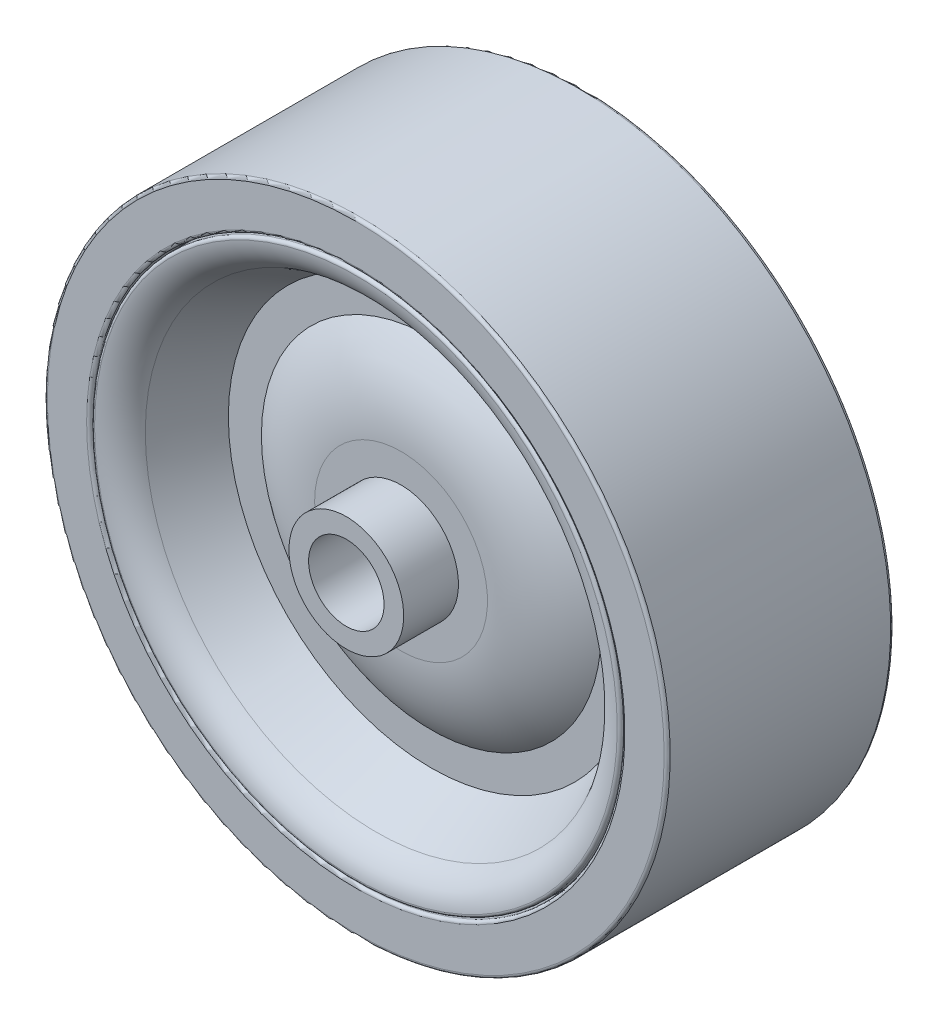
ISO-10303-21;
HEADER;
FILE_DESCRIPTION(('STEP AP214'),'2;1');
FILE_NAME('part.step','',(''),(''),'','','');
FILE_SCHEMA(('AUTOMOTIVE_DESIGN { 1 0 10303 214 1 1 1 1 }'));
ENDSEC;
DATA;
#1=APPLICATION_CONTEXT('core data for automotive mechanical design processes');
#2=APPLICATION_PROTOCOL_DEFINITION('international standard','automotive_design',2000,#1);
#3=PRODUCT_CONTEXT('',#1,'mechanical');
#4=PRODUCT('Part','Part','',(#3));
#5=PRODUCT_RELATED_PRODUCT_CATEGORY('part','',(#4));
#6=PRODUCT_DEFINITION_FORMATION('','',#4);
#7=PRODUCT_DEFINITION_CONTEXT('part definition',#1,'design');
#8=PRODUCT_DEFINITION('design','',#6,#7);
#9=PRODUCT_DEFINITION_SHAPE('','',#8);
#10=(LENGTH_UNIT() NAMED_UNIT(*) SI_UNIT(.MILLI.,.METRE.));
#11=(NAMED_UNIT(*) PLANE_ANGLE_UNIT() SI_UNIT($,.RADIAN.));
#12=(NAMED_UNIT(*) SI_UNIT($,.STERADIAN.) SOLID_ANGLE_UNIT());
#13=UNCERTAINTY_MEASURE_WITH_UNIT(LENGTH_MEASURE(1.E-05),#10,'distance_accuracy_value','');
#14=(GEOMETRIC_REPRESENTATION_CONTEXT(3) GLOBAL_UNCERTAINTY_ASSIGNED_CONTEXT((#13)) GLOBAL_UNIT_ASSIGNED_CONTEXT((#10,
#11,#12)) REPRESENTATION_CONTEXT('',''));
#15=CARTESIAN_POINT('',(0.,0.,0.));
#16=DIRECTION('',(0.,0.,1.));
#17=DIRECTION('',(1.,0.,0.));
#18=AXIS2_PLACEMENT_3D('',#15,#16,#17);
#19=CARTESIAN_POINT('',(0.,0.,-10.31875));
#20=DIRECTION('',(0.,0.,-1.));
#21=DIRECTION('',(-1.,0.,0.));
#22=AXIS2_PLACEMENT_3D('',#19,#20,#21);
#23=CYLINDRICAL_SURFACE('',#22,26.19375);
#24=CARTESIAN_POINT('',(0.,0.,-9.271));
#25=DIRECTION('',(0.,0.,-1.));
#26=DIRECTION('',(-1.,0.,0.));
#27=AXIS2_PLACEMENT_3D('',#24,#25,#26);
#28=CIRCLE('',#27,26.19375);
#29=CARTESIAN_POINT('',(-26.19375,0.,-9.271));
#30=VERTEX_POINT('',#29);
#31=EDGE_CURVE('E45',#30,#30,#28,.F.);
#32=ORIENTED_EDGE('',*,*,#31,.T.);
#33=EDGE_LOOP('',(#32));
#34=FACE_BOUND('',#33,.T.);
#35=CARTESIAN_POINT('',(0.,0.,9.271));
#36=DIRECTION('',(0.,0.,-1.));
#37=DIRECTION('',(-1.,0.,0.));
#38=AXIS2_PLACEMENT_3D('',#35,#36,#37);
#39=CIRCLE('',#38,26.19375);
#40=CARTESIAN_POINT('',(-26.19375,0.,9.271));
#41=VERTEX_POINT('',#40);
#42=EDGE_CURVE('E92',#41,#41,#39,.F.);
#43=ORIENTED_EDGE('',*,*,#42,.F.);
#44=EDGE_LOOP('',(#43));
#45=FACE_BOUND('',#44,.T.);
#46=ADVANCED_FACE('F30',(#34,#45),#23,.T.);
#47=CARTESIAN_POINT('',(-1.82909978638645E-13,-26.19375,-9.525));
#48=DIRECTION('',(0.,0.,-1.));
#49=DIRECTION('',(-1.,0.,0.));
#50=AXIS2_PLACEMENT_3D('',#47,#48,#49);
#51=PLANE('',#50);
#52=CARTESIAN_POINT('',(0.,0.,-9.525));
#53=DIRECTION('',(0.,0.,-1.));
#54=DIRECTION('',(-1.,0.,0.));
#55=AXIS2_PLACEMENT_3D('',#52,#53,#54);
#56=CIRCLE('',#55,25.93975);
#57=CARTESIAN_POINT('',(-25.93975,0.,-9.525));
#58=VERTEX_POINT('',#57);
#59=EDGE_CURVE('E50',#58,#58,#56,.T.);
#60=ORIENTED_EDGE('',*,*,#59,.T.);
#61=EDGE_LOOP('',(#60));
#62=FACE_BOUND('',#61,.T.);
#63=CARTESIAN_POINT('',(0.,0.,-9.525));
#64=DIRECTION('',(0.,0.,-1.));
#65=DIRECTION('',(-1.,0.,0.));
#66=AXIS2_PLACEMENT_3D('',#63,#64,#65);
#67=CIRCLE('',#66,22.63775);
#68=CARTESIAN_POINT('',(-22.63775,0.,-9.525));
#69=VERTEX_POINT('',#68);
#70=EDGE_CURVE('E53',#69,#69,#67,.F.);
#71=ORIENTED_EDGE('',*,*,#70,.T.);
#72=EDGE_LOOP('',(#71));
#73=FACE_BOUND('',#72,.T.);
#74=ADVANCED_FACE('F149',(#62,#73),#51,.T.);
#75=CARTESIAN_POINT('',(0.,0.,-10.31875));
#76=DIRECTION('',(0.,0.,-1.));
#77=DIRECTION('',(-1.,0.,0.));
#78=AXIS2_PLACEMENT_3D('',#75,#76,#77);
#79=CYLINDRICAL_SURFACE('',#78,22.38375);
#80=CARTESIAN_POINT('',(0.,0.,-9.271));
#81=DIRECTION('',(0.,0.,-1.));
#82=DIRECTION('',(-1.,0.,0.));
#83=AXIS2_PLACEMENT_3D('',#80,#81,#82);
#84=CIRCLE('',#83,22.38375);
#85=CARTESIAN_POINT('',(-22.38375,0.,-9.271));
#86=VERTEX_POINT('',#85);
#87=EDGE_CURVE('E41',#86,#86,#84,.T.);
#88=ORIENTED_EDGE('',*,*,#87,.T.);
#89=EDGE_LOOP('',(#88));
#90=FACE_BOUND('',#89,.T.);
#91=CARTESIAN_POINT('',(0.,0.,-6.985));
#92=DIRECTION('',(0.,0.,-1.));
#93=DIRECTION('',(-1.,0.,0.));
#94=AXIS2_PLACEMENT_3D('',#91,#92,#93);
#95=CIRCLE('',#94,22.38375);
#96=CARTESIAN_POINT('',(-22.38375,0.,-6.985));
#97=VERTEX_POINT('',#96);
#98=EDGE_CURVE('E56',#97,#97,#95,.T.);
#99=ORIENTED_EDGE('',*,*,#98,.F.);
#100=EDGE_LOOP('',(#99));
#101=FACE_BOUND('',#100,.T.);
#102=ADVANCED_FACE('F155',(#90,#101),#79,.F.);
#103=CARTESIAN_POINT('',(-1.5630489083666E-13,-22.38375,-6.985));
#104=DIRECTION('',(0.,0.,-1.));
#105=DIRECTION('',(-1.,0.,0.));
#106=AXIS2_PLACEMENT_3D('',#103,#104,#105);
#107=PLANE('',#106);
#108=ORIENTED_EDGE('',*,*,#98,.T.);
#109=EDGE_LOOP('',(#108));
#110=FACE_BOUND('',#109,.T.);
#111=CARTESIAN_POINT('',(0.,0.,-6.985));
#112=DIRECTION('',(0.,0.,-1.));
#113=DIRECTION('',(-1.,0.,0.));
#114=AXIS2_PLACEMENT_3D('',#111,#112,#113);
#115=CIRCLE('',#114,22.25675);
#116=CARTESIAN_POINT('',(-22.25675,0.,-6.985));
#117=VERTEX_POINT('',#116);
#118=EDGE_CURVE('E59',#117,#117,#115,.T.);
#119=ORIENTED_EDGE('',*,*,#118,.F.);
#120=EDGE_LOOP('',(#119));
#121=FACE_BOUND('',#120,.T.);
#122=ADVANCED_FACE('F173',(#110,#121),#107,.T.);
#123=CARTESIAN_POINT('',(0.,0.,-10.31875));
#124=DIRECTION('',(0.,0.,-1.));
#125=DIRECTION('',(-1.,0.,0.));
#126=AXIS2_PLACEMENT_3D('',#123,#124,#125);
#127=CYLINDRICAL_SURFACE('',#126,22.25675);
#128=CARTESIAN_POINT('',(0.,0.,-9.25993556629696));
#129=DIRECTION('',(0.,0.,1.));
#130=DIRECTION('',(1.,0.,0.));
#131=AXIS2_PLACEMENT_3D('',#128,#129,#130);
#132=CIRCLE('',#131,22.25675);
#133=CARTESIAN_POINT('',(22.25675,0.,-9.25993556629696));
#134=VERTEX_POINT('',#133);
#135=EDGE_CURVE('E10',#134,#134,#132,.T.);
#136=ORIENTED_EDGE('',*,*,#135,.T.);
#137=EDGE_LOOP('',(#136));
#138=FACE_BOUND('',#137,.T.);
#139=ORIENTED_EDGE('',*,*,#118,.T.);
#140=EDGE_LOOP('',(#139));
#141=FACE_BOUND('',#140,.T.);
#142=ADVANCED_FACE('F178',(#138,#141),#127,.T.);
#143=CARTESIAN_POINT('',(0.,0.,-6.35));
#144=DIRECTION('',(0.,0.,-1.));
#145=DIRECTION('',(-1.,0.,0.));
#146=AXIS2_PLACEMENT_3D('',#143,#144,#145);
#147=TOROIDAL_SURFACE('',#146,22.25675,3.175);
#148=CARTESIAN_POINT('',(0.,0.,-9.51297344162677));
#149=DIRECTION('',(0.,0.,1.));
#150=DIRECTION('',(1.,0.,0.));
#151=AXIS2_PLACEMENT_3D('',#148,#149,#150);
#152=CIRCLE('',#151,21.9806630434783);
#153=CARTESIAN_POINT('',(21.9806630434783,0.,-9.51297344162677));
#154=VERTEX_POINT('',#153);
#155=EDGE_CURVE('E37',#154,#154,#152,.F.);
#156=ORIENTED_EDGE('',*,*,#155,.T.);
#157=EDGE_LOOP('',(#156));
#158=FACE_BOUND('',#157,.T.);
#159=CARTESIAN_POINT('',(0.,0.,-7.79627388058178));
#160=DIRECTION('',(0.,0.,-1.));
#161=DIRECTION('',(-1.,0.,0.));
#162=AXIS2_PLACEMENT_3D('',#159,#160,#161);
#163=CIRCLE('',#162,19.4302827947512);
#164=CARTESIAN_POINT('',(-19.4302827947512,0.,-7.79627388058178));
#165=VERTEX_POINT('',#164);
#166=EDGE_CURVE('E62',#165,#165,#163,.T.);
#167=ORIENTED_EDGE('',*,*,#166,.F.);
#168=EDGE_LOOP('',(#167));
#169=FACE_BOUND('',#168,.T.);
#170=ADVANCED_FACE('F183',(#158,#169),#147,.T.);
#171=CARTESIAN_POINT('',(0.,0.,-3.17499999999999));
#172=DIRECTION('',(0.,0.,-1.));
#173=DIRECTION('',(-1.,0.,0.));
#174=AXIS2_PLACEMENT_3D('',#171,#172,#173);
#175=CONICAL_SURFACE('',#174,17.065625,0.472955498677827);
#176=ORIENTED_EDGE('',*,*,#166,.T.);
#177=EDGE_LOOP('',(#176));
#178=FACE_BOUND('',#177,.T.);
#179=CARTESIAN_POINT('',(0.,0.,-3.17499999999999));
#180=DIRECTION('',(0.,0.,-1.));
#181=DIRECTION('',(-1.,0.,0.));
#182=AXIS2_PLACEMENT_3D('',#179,#180,#181);
#183=CIRCLE('',#182,17.065625);
#184=CARTESIAN_POINT('',(-17.065625,0.,-3.17499999999999));
#185=VERTEX_POINT('',#184);
#186=EDGE_CURVE('E65',#185,#185,#183,.T.);
#187=ORIENTED_EDGE('',*,*,#186,.F.);
#188=EDGE_LOOP('',(#187));
#189=FACE_BOUND('',#188,.T.);
#190=ADVANCED_FACE('F188',(#178,#189),#175,.F.);
#191=CARTESIAN_POINT('',(0.,-14.2875,-3.17499999999999));
#192=DIRECTION('',(0.,0.,-1.));
#193=DIRECTION('',(-1.,0.,0.));
#194=AXIS2_PLACEMENT_3D('',#191,#192,#193);
#195=PLANE('',#194);
#196=ORIENTED_EDGE('',*,*,#186,.T.);
#197=EDGE_LOOP('',(#196));
#198=FACE_BOUND('',#197,.T.);
#199=CARTESIAN_POINT('',(0.,0.,-3.17499999999999));
#200=DIRECTION('',(0.,0.,-1.));
#201=DIRECTION('',(-1.,0.,0.));
#202=AXIS2_PLACEMENT_3D('',#199,#200,#201);
#203=CIRCLE('',#202,14.2875);
#204=CARTESIAN_POINT('',(-14.2875,0.,-3.17499999999999));
#205=VERTEX_POINT('',#204);
#206=EDGE_CURVE('E68',#205,#205,#203,.T.);
#207=ORIENTED_EDGE('',*,*,#206,.F.);
#208=EDGE_LOOP('',(#207));
#209=FACE_BOUND('',#208,.T.);
#210=ADVANCED_FACE('F193',(#198,#209),#195,.T.);
#211=CARTESIAN_POINT('',(0.,0.,5.25045778842444));
#212=DIRECTION('',(0.,0.,-1.));
#213=DIRECTION('',(-1.,0.,0.));
#214=AXIS2_PLACEMENT_3D('',#211,#212,#213);
#215=DEGENERATE_TOROIDAL_SURFACE('',#214,7.26945714139644,10.9654577884244,.T.);
#216=ORIENTED_EDGE('',*,*,#206,.T.);
#217=EDGE_LOOP('',(#216));
#218=FACE_BOUND('',#217,.T.);
#219=CARTESIAN_POINT('',(0.,0.,-5.715));
#220=DIRECTION('',(0.,0.,-1.));
#221=DIRECTION('',(-1.,0.,0.));
#222=AXIS2_PLACEMENT_3D('',#219,#220,#221);
#223=CIRCLE('',#222,7.26945714139644);
#224=CARTESIAN_POINT('',(-7.26945714139644,0.,-5.715));
#225=VERTEX_POINT('',#224);
#226=EDGE_CURVE('E71',#225,#225,#223,.T.);
#227=ORIENTED_EDGE('',*,*,#226,.F.);
#228=EDGE_LOOP('',(#227));
#229=FACE_BOUND('',#228,.T.);
#230=ADVANCED_FACE('F197',(#218,#229),#215,.T.);
#231=CARTESIAN_POINT('',(0.,-7.26945714139645,-5.715));
#232=DIRECTION('',(0.,0.,-1.));
#233=DIRECTION('',(-1.,0.,0.));
#234=AXIS2_PLACEMENT_3D('',#231,#232,#233);
#235=PLANE('',#234);
#236=ORIENTED_EDGE('',*,*,#226,.T.);
#237=EDGE_LOOP('',(#236));
#238=FACE_BOUND('',#237,.T.);
#239=CARTESIAN_POINT('',(0.,0.,-5.715));
#240=DIRECTION('',(0.,0.,-1.));
#241=DIRECTION('',(-1.,0.,0.));
#242=AXIS2_PLACEMENT_3D('',#239,#240,#241);
#243=CIRCLE('',#242,4.826);
#244=CARTESIAN_POINT('',(-4.826,0.,-5.715));
#245=VERTEX_POINT('',#244);
#246=EDGE_CURVE('E74',#245,#245,#243,.T.);
#247=ORIENTED_EDGE('',*,*,#246,.F.);
#248=EDGE_LOOP('',(#247));
#249=FACE_BOUND('',#248,.T.);
#250=ADVANCED_FACE('F201',(#238,#249),#235,.T.);
#251=CARTESIAN_POINT('',(0.,0.,-10.31875));
#252=DIRECTION('',(0.,0.,-1.));
#253=DIRECTION('',(-1.,0.,0.));
#254=AXIS2_PLACEMENT_3D('',#251,#252,#253);
#255=CYLINDRICAL_SURFACE('',#254,4.826);
#256=ORIENTED_EDGE('',*,*,#246,.T.);
#257=EDGE_LOOP('',(#256));
#258=FACE_BOUND('',#257,.T.);
#259=CARTESIAN_POINT('',(0.,0.,-10.31875));
#260=DIRECTION('',(0.,0.,-1.));
#261=DIRECTION('',(-1.,0.,0.));
#262=AXIS2_PLACEMENT_3D('',#259,#260,#261);
#263=CIRCLE('',#262,4.826);
#264=CARTESIAN_POINT('',(-4.826,0.,-10.31875));
#265=VERTEX_POINT('',#264);
#266=EDGE_CURVE('E77',#265,#265,#263,.T.);
#267=ORIENTED_EDGE('',*,*,#266,.F.);
#268=EDGE_LOOP('',(#267));
#269=FACE_BOUND('',#268,.T.);
#270=ADVANCED_FACE('F144',(#258,#269),#255,.T.);
#271=CARTESIAN_POINT('',(0.,-3.175,-10.31875));
#272=DIRECTION('',(0.,0.,-1.));
#273=DIRECTION('',(-1.,0.,0.));
#274=AXIS2_PLACEMENT_3D('',#271,#272,#273);
#275=PLANE('',#274);
#276=ORIENTED_EDGE('',*,*,#266,.T.);
#277=EDGE_LOOP('',(#276));
#278=FACE_BOUND('',#277,.T.);
#279=CARTESIAN_POINT('',(0.,0.,-10.31875));
#280=DIRECTION('',(0.,0.,-1.));
#281=DIRECTION('',(-1.,0.,0.));
#282=AXIS2_PLACEMENT_3D('',#279,#280,#281);
#283=CIRCLE('',#282,3.175);
#284=CARTESIAN_POINT('',(-3.175,0.,-10.31875));
#285=VERTEX_POINT('',#284);
#286=EDGE_CURVE('E80',#285,#285,#283,.T.);
#287=ORIENTED_EDGE('',*,*,#286,.F.);
#288=EDGE_LOOP('',(#287));
#289=FACE_BOUND('',#288,.T.);
#290=ADVANCED_FACE('F134',(#278,#289),#275,.T.);
#291=CARTESIAN_POINT('',(0.,0.,-10.31875));
#292=DIRECTION('',(0.,0.,-1.));
#293=DIRECTION('',(-1.,0.,0.));
#294=AXIS2_PLACEMENT_3D('',#291,#292,#293);
#295=CYLINDRICAL_SURFACE('',#294,3.175);
#296=ORIENTED_EDGE('',*,*,#286,.T.);
#297=EDGE_LOOP('',(#296));
#298=FACE_BOUND('',#297,.T.);
#299=CARTESIAN_POINT('',(0.,0.,10.31875));
#300=DIRECTION('',(0.,0.,-1.));
#301=DIRECTION('',(-1.,0.,0.));
#302=AXIS2_PLACEMENT_3D('',#299,#300,#301);
#303=CIRCLE('',#302,3.175);
#304=CARTESIAN_POINT('',(-3.175,0.,10.31875));
#305=VERTEX_POINT('',#304);
#306=EDGE_CURVE('E125',#305,#305,#303,.T.);
#307=ORIENTED_EDGE('',*,*,#306,.F.);
#308=EDGE_LOOP('',(#307));
#309=FACE_BOUND('',#308,.T.);
#310=ADVANCED_FACE('F131',(#298,#309),#295,.F.);
#311=CARTESIAN_POINT('',(0.,0.,-9.271));
#312=DIRECTION('',(0.,0.,-1.));
#313=DIRECTION('',(-1.,0.,0.));
#314=AXIS2_PLACEMENT_3D('',#311,#312,#313);
#315=TOROIDAL_SURFACE('',#314,25.93975,0.254);
#316=ORIENTED_EDGE('',*,*,#31,.F.);
#317=EDGE_LOOP('',(#316));
#318=FACE_BOUND('',#317,.T.);
#319=ORIENTED_EDGE('',*,*,#59,.F.);
#320=EDGE_LOOP('',(#319));
#321=FACE_BOUND('',#320,.T.);
#322=ADVANCED_FACE('F133',(#318,#321),#315,.T.);
#323=CARTESIAN_POINT('',(0.,0.,-9.271));
#324=DIRECTION('',(0.,0.,-1.));
#325=DIRECTION('',(-1.,0.,0.));
#326=AXIS2_PLACEMENT_3D('',#323,#324,#325);
#327=TOROIDAL_SURFACE('',#326,22.63775,0.254);
#328=ORIENTED_EDGE('',*,*,#70,.F.);
#329=EDGE_LOOP('',(#328));
#330=FACE_BOUND('',#329,.T.);
#331=ORIENTED_EDGE('',*,*,#87,.F.);
#332=EDGE_LOOP('',(#331));
#333=FACE_BOUND('',#332,.T.);
#334=ADVANCED_FACE('F141',(#330,#333),#327,.T.);
#335=CARTESIAN_POINT('',(0.,0.,-9.25993556629696));
#336=DIRECTION('',(0.,0.,1.));
#337=DIRECTION('',(1.,0.,0.));
#338=AXIS2_PLACEMENT_3D('',#335,#336,#337);
#339=TOROIDAL_SURFACE('',#338,22.00275,0.254);
#340=ORIENTED_EDGE('',*,*,#135,.F.);
#341=EDGE_LOOP('',(#340));
#342=FACE_BOUND('',#341,.T.);
#343=ORIENTED_EDGE('',*,*,#155,.F.);
#344=EDGE_LOOP('',(#343));
#345=FACE_BOUND('',#344,.T.);
#346=ADVANCED_FACE('F32',(#342,#345),#339,.T.);
#347=CARTESIAN_POINT('',(-1.82909978638645E-13,-26.19375,9.525));
#348=DIRECTION('',(0.,0.,1.));
#349=DIRECTION('',(-1.,0.,0.));
#350=AXIS2_PLACEMENT_3D('',#347,#348,#349);
#351=PLANE('',#350);
#352=CARTESIAN_POINT('',(0.,0.,9.525));
#353=DIRECTION('',(0.,0.,-1.));
#354=DIRECTION('',(-1.,0.,0.));
#355=AXIS2_PLACEMENT_3D('',#352,#353,#354);
#356=CIRCLE('',#355,25.93975);
#357=CARTESIAN_POINT('',(-25.93975,0.,9.525));
#358=VERTEX_POINT('',#357);
#359=EDGE_CURVE('E95',#358,#358,#356,.T.);
#360=ORIENTED_EDGE('',*,*,#359,.F.);
#361=EDGE_LOOP('',(#360));
#362=FACE_BOUND('',#361,.T.);
#363=CARTESIAN_POINT('',(0.,0.,9.525));
#364=DIRECTION('',(0.,0.,-1.));
#365=DIRECTION('',(-1.,0.,0.));
#366=AXIS2_PLACEMENT_3D('',#363,#364,#365);
#367=CIRCLE('',#366,22.63775);
#368=CARTESIAN_POINT('',(-22.63775,0.,9.525));
#369=VERTEX_POINT('',#368);
#370=EDGE_CURVE('E98',#369,#369,#367,.F.);
#371=ORIENTED_EDGE('',*,*,#370,.F.);
#372=EDGE_LOOP('',(#371));
#373=FACE_BOUND('',#372,.T.);
#374=ADVANCED_FACE('F165',(#362,#373),#351,.T.);
#375=CARTESIAN_POINT('',(0.,0.,10.31875));
#376=DIRECTION('',(0.,0.,1.));
#377=DIRECTION('',(-1.,0.,0.));
#378=AXIS2_PLACEMENT_3D('',#375,#376,#377);
#379=CYLINDRICAL_SURFACE('',#378,22.38375);
#380=CARTESIAN_POINT('',(0.,0.,9.271));
#381=DIRECTION('',(0.,0.,-1.));
#382=DIRECTION('',(-1.,0.,0.));
#383=AXIS2_PLACEMENT_3D('',#380,#381,#382);
#384=CIRCLE('',#383,22.38375);
#385=CARTESIAN_POINT('',(-22.38375,0.,9.271));
#386=VERTEX_POINT('',#385);
#387=EDGE_CURVE('E89',#386,#386,#384,.T.);
#388=ORIENTED_EDGE('',*,*,#387,.F.);
#389=EDGE_LOOP('',(#388));
#390=FACE_BOUND('',#389,.T.);
#391=CARTESIAN_POINT('',(0.,0.,6.985));
#392=DIRECTION('',(0.,0.,-1.));
#393=DIRECTION('',(-1.,0.,0.));
#394=AXIS2_PLACEMENT_3D('',#391,#392,#393);
#395=CIRCLE('',#394,22.38375);
#396=CARTESIAN_POINT('',(-22.38375,0.,6.985));
#397=VERTEX_POINT('',#396);
#398=EDGE_CURVE('E101',#397,#397,#395,.T.);
#399=ORIENTED_EDGE('',*,*,#398,.T.);
#400=EDGE_LOOP('',(#399));
#401=FACE_BOUND('',#400,.T.);
#402=ADVANCED_FACE('F309',(#390,#401),#379,.F.);
#403=CARTESIAN_POINT('',(-1.5630489083666E-13,-22.38375,6.985));
#404=DIRECTION('',(0.,0.,1.));
#405=DIRECTION('',(-1.,0.,0.));
#406=AXIS2_PLACEMENT_3D('',#403,#404,#405);
#407=PLANE('',#406);
#408=ORIENTED_EDGE('',*,*,#398,.F.);
#409=EDGE_LOOP('',(#408));
#410=FACE_BOUND('',#409,.T.);
#411=CARTESIAN_POINT('',(0.,0.,6.985));
#412=DIRECTION('',(0.,0.,-1.));
#413=DIRECTION('',(-1.,0.,0.));
#414=AXIS2_PLACEMENT_3D('',#411,#412,#413);
#415=CIRCLE('',#414,22.25675);
#416=CARTESIAN_POINT('',(-22.25675,0.,6.985));
#417=VERTEX_POINT('',#416);
#418=EDGE_CURVE('E104',#417,#417,#415,.T.);
#419=ORIENTED_EDGE('',*,*,#418,.T.);
#420=EDGE_LOOP('',(#419));
#421=FACE_BOUND('',#420,.T.);
#422=ADVANCED_FACE('F319',(#410,#421),#407,.T.);
#423=CARTESIAN_POINT('',(0.,0.,10.31875));
#424=DIRECTION('',(0.,0.,1.));
#425=DIRECTION('',(-1.,0.,0.));
#426=AXIS2_PLACEMENT_3D('',#423,#424,#425);
#427=CYLINDRICAL_SURFACE('',#426,22.25675);
#428=CARTESIAN_POINT('',(0.,0.,9.25993556629696));
#429=DIRECTION('',(0.,0.,1.));
#430=DIRECTION('',(1.,0.,0.));
#431=AXIS2_PLACEMENT_3D('',#428,#429,#430);
#432=CIRCLE('',#431,22.25675);
#433=CARTESIAN_POINT('',(22.25675,0.,9.25993556629696));
#434=VERTEX_POINT('',#433);
#435=EDGE_CURVE('E83',#434,#434,#432,.T.);
#436=ORIENTED_EDGE('',*,*,#435,.F.);
#437=EDGE_LOOP('',(#436));
#438=FACE_BOUND('',#437,.T.);
#439=ORIENTED_EDGE('',*,*,#418,.F.);
#440=EDGE_LOOP('',(#439));
#441=FACE_BOUND('',#440,.T.);
#442=ADVANCED_FACE('F329',(#438,#441),#427,.T.);
#443=CARTESIAN_POINT('',(0.,0.,6.35));
#444=DIRECTION('',(0.,0.,1.));
#445=DIRECTION('',(-1.,0.,0.));
#446=AXIS2_PLACEMENT_3D('',#443,#444,#445);
#447=TOROIDAL_SURFACE('',#446,22.25675,3.175);
#448=CARTESIAN_POINT('',(0.,0.,9.51297344162677));
#449=DIRECTION('',(0.,0.,1.));
#450=DIRECTION('',(1.,0.,0.));
#451=AXIS2_PLACEMENT_3D('',#448,#449,#450);
#452=CIRCLE('',#451,21.9806630434783);
#453=CARTESIAN_POINT('',(21.9806630434783,0.,9.51297344162677));
#454=VERTEX_POINT('',#453);
#455=EDGE_CURVE('E86',#454,#454,#452,.F.);
#456=ORIENTED_EDGE('',*,*,#455,.F.);
#457=EDGE_LOOP('',(#456));
#458=FACE_BOUND('',#457,.T.);
#459=CARTESIAN_POINT('',(0.,0.,7.79627388058178));
#460=DIRECTION('',(0.,0.,-1.));
#461=DIRECTION('',(-1.,0.,0.));
#462=AXIS2_PLACEMENT_3D('',#459,#460,#461);
#463=CIRCLE('',#462,19.4302827947512);
#464=CARTESIAN_POINT('',(-19.4302827947512,0.,7.79627388058178));
#465=VERTEX_POINT('',#464);
#466=EDGE_CURVE('E107',#465,#465,#463,.T.);
#467=ORIENTED_EDGE('',*,*,#466,.T.);
#468=EDGE_LOOP('',(#467));
#469=FACE_BOUND('',#468,.T.);
#470=ADVANCED_FACE('F339',(#458,#469),#447,.T.);
#471=CARTESIAN_POINT('',(0.,0.,3.17499999999999));
#472=DIRECTION('',(0.,0.,1.));
#473=DIRECTION('',(-1.,0.,0.));
#474=AXIS2_PLACEMENT_3D('',#471,#472,#473);
#475=CONICAL_SURFACE('',#474,17.065625,0.472955498677827);
#476=ORIENTED_EDGE('',*,*,#466,.F.);
#477=EDGE_LOOP('',(#476));
#478=FACE_BOUND('',#477,.T.);
#479=CARTESIAN_POINT('',(0.,0.,3.17499999999999));
#480=DIRECTION('',(0.,0.,-1.));
#481=DIRECTION('',(-1.,0.,0.));
#482=AXIS2_PLACEMENT_3D('',#479,#480,#481);
#483=CIRCLE('',#482,17.065625);
#484=CARTESIAN_POINT('',(-17.065625,0.,3.17499999999999));
#485=VERTEX_POINT('',#484);
#486=EDGE_CURVE('E110',#485,#485,#483,.T.);
#487=ORIENTED_EDGE('',*,*,#486,.T.);
#488=EDGE_LOOP('',(#487));
#489=FACE_BOUND('',#488,.T.);
#490=ADVANCED_FACE('F349',(#478,#489),#475,.F.);
#491=CARTESIAN_POINT('',(0.,-14.2875,3.17499999999999));
#492=DIRECTION('',(0.,0.,1.));
#493=DIRECTION('',(-1.,0.,0.));
#494=AXIS2_PLACEMENT_3D('',#491,#492,#493);
#495=PLANE('',#494);
#496=ORIENTED_EDGE('',*,*,#486,.F.);
#497=EDGE_LOOP('',(#496));
#498=FACE_BOUND('',#497,.T.);
#499=CARTESIAN_POINT('',(0.,0.,3.17499999999999));
#500=DIRECTION('',(0.,0.,-1.));
#501=DIRECTION('',(-1.,0.,0.));
#502=AXIS2_PLACEMENT_3D('',#499,#500,#501);
#503=CIRCLE('',#502,14.2875);
#504=CARTESIAN_POINT('',(-14.2875,0.,3.17499999999999));
#505=VERTEX_POINT('',#504);
#506=EDGE_CURVE('E113',#505,#505,#503,.T.);
#507=ORIENTED_EDGE('',*,*,#506,.T.);
#508=EDGE_LOOP('',(#507));
#509=FACE_BOUND('',#508,.T.);
#510=ADVANCED_FACE('F359',(#498,#509),#495,.T.);
#511=CARTESIAN_POINT('',(0.,0.,-5.25045778842444));
#512=DIRECTION('',(0.,0.,1.));
#513=DIRECTION('',(-1.,0.,0.));
#514=AXIS2_PLACEMENT_3D('',#511,#512,#513);
#515=DEGENERATE_TOROIDAL_SURFACE('',#514,7.26945714139644,10.9654577884244,.T.);
#516=ORIENTED_EDGE('',*,*,#506,.F.);
#517=EDGE_LOOP('',(#516));
#518=FACE_BOUND('',#517,.T.);
#519=CARTESIAN_POINT('',(0.,0.,5.715));
#520=DIRECTION('',(0.,0.,-1.));
#521=DIRECTION('',(-1.,0.,0.));
#522=AXIS2_PLACEMENT_3D('',#519,#520,#521);
#523=CIRCLE('',#522,7.26945714139644);
#524=CARTESIAN_POINT('',(-7.26945714139644,0.,5.715));
#525=VERTEX_POINT('',#524);
#526=EDGE_CURVE('E116',#525,#525,#523,.T.);
#527=ORIENTED_EDGE('',*,*,#526,.T.);
#528=EDGE_LOOP('',(#527));
#529=FACE_BOUND('',#528,.T.);
#530=ADVANCED_FACE('F369',(#518,#529),#515,.T.);
#531=CARTESIAN_POINT('',(0.,-7.26945714139645,5.715));
#532=DIRECTION('',(0.,0.,1.));
#533=DIRECTION('',(-1.,0.,0.));
#534=AXIS2_PLACEMENT_3D('',#531,#532,#533);
#535=PLANE('',#534);
#536=ORIENTED_EDGE('',*,*,#526,.F.);
#537=EDGE_LOOP('',(#536));
#538=FACE_BOUND('',#537,.T.);
#539=CARTESIAN_POINT('',(0.,0.,5.715));
#540=DIRECTION('',(0.,0.,-1.));
#541=DIRECTION('',(-1.,0.,0.));
#542=AXIS2_PLACEMENT_3D('',#539,#540,#541);
#543=CIRCLE('',#542,4.826);
#544=CARTESIAN_POINT('',(-4.826,0.,5.715));
#545=VERTEX_POINT('',#544);
#546=EDGE_CURVE('E119',#545,#545,#543,.T.);
#547=ORIENTED_EDGE('',*,*,#546,.T.);
#548=EDGE_LOOP('',(#547));
#549=FACE_BOUND('',#548,.T.);
#550=ADVANCED_FACE('F379',(#538,#549),#535,.T.);
#551=CARTESIAN_POINT('',(0.,0.,10.31875));
#552=DIRECTION('',(0.,0.,1.));
#553=DIRECTION('',(-1.,0.,0.));
#554=AXIS2_PLACEMENT_3D('',#551,#552,#553);
#555=CYLINDRICAL_SURFACE('',#554,4.826);
#556=ORIENTED_EDGE('',*,*,#546,.F.);
#557=EDGE_LOOP('',(#556));
#558=FACE_BOUND('',#557,.T.);
#559=CARTESIAN_POINT('',(0.,0.,10.31875));
#560=DIRECTION('',(0.,0.,-1.));
#561=DIRECTION('',(-1.,0.,0.));
#562=AXIS2_PLACEMENT_3D('',#559,#560,#561);
#563=CIRCLE('',#562,4.826);
#564=CARTESIAN_POINT('',(-4.826,0.,10.31875));
#565=VERTEX_POINT('',#564);
#566=EDGE_CURVE('E122',#565,#565,#563,.T.);
#567=ORIENTED_EDGE('',*,*,#566,.T.);
#568=EDGE_LOOP('',(#567));
#569=FACE_BOUND('',#568,.T.);
#570=ADVANCED_FACE('F389',(#558,#569),#555,.T.);
#571=CARTESIAN_POINT('',(0.,-3.175,10.31875));
#572=DIRECTION('',(0.,0.,1.));
#573=DIRECTION('',(-1.,0.,0.));
#574=AXIS2_PLACEMENT_3D('',#571,#572,#573);
#575=PLANE('',#574);
#576=ORIENTED_EDGE('',*,*,#566,.F.);
#577=EDGE_LOOP('',(#576));
#578=FACE_BOUND('',#577,.T.);
#579=ORIENTED_EDGE('',*,*,#306,.T.);
#580=EDGE_LOOP('',(#579));
#581=FACE_BOUND('',#580,.T.);
#582=ADVANCED_FACE('F129',(#578,#581),#575,.T.);
#583=CARTESIAN_POINT('',(0.,0.,9.271));
#584=DIRECTION('',(0.,0.,1.));
#585=DIRECTION('',(-1.,0.,0.));
#586=AXIS2_PLACEMENT_3D('',#583,#584,#585);
#587=TOROIDAL_SURFACE('',#586,25.93975,0.254);
#588=ORIENTED_EDGE('',*,*,#42,.T.);
#589=EDGE_LOOP('',(#588));
#590=FACE_BOUND('',#589,.T.);
#591=ORIENTED_EDGE('',*,*,#359,.T.);
#592=EDGE_LOOP('',(#591));
#593=FACE_BOUND('',#592,.T.);
#594=ADVANCED_FACE('F408',(#590,#593),#587,.T.);
#595=CARTESIAN_POINT('',(0.,0.,9.271));
#596=DIRECTION('',(0.,0.,1.));
#597=DIRECTION('',(-1.,0.,0.));
#598=AXIS2_PLACEMENT_3D('',#595,#596,#597);
#599=TOROIDAL_SURFACE('',#598,22.63775,0.254);
#600=ORIENTED_EDGE('',*,*,#370,.T.);
#601=EDGE_LOOP('',(#600));
#602=FACE_BOUND('',#601,.T.);
#603=ORIENTED_EDGE('',*,*,#387,.T.);
#604=EDGE_LOOP('',(#603));
#605=FACE_BOUND('',#604,.T.);
#606=ADVANCED_FACE('F418',(#602,#605),#599,.T.);
#607=CARTESIAN_POINT('',(0.,0.,9.25993556629696));
#608=DIRECTION('',(0.,0.,-1.));
#609=DIRECTION('',(1.,0.,0.));
#610=AXIS2_PLACEMENT_3D('',#607,#608,#609);
#611=TOROIDAL_SURFACE('',#610,22.00275,0.254);
#612=ORIENTED_EDGE('',*,*,#435,.T.);
#613=EDGE_LOOP('',(#612));
#614=FACE_BOUND('',#613,.T.);
#615=ORIENTED_EDGE('',*,*,#455,.T.);
#616=EDGE_LOOP('',(#615));
#617=FACE_BOUND('',#616,.T.);
#618=ADVANCED_FACE('F428',(#614,#617),#611,.T.);
#619=CLOSED_SHELL('',(#46,#74,#102,#122,#142,#170,#190,#210,#230,#250,#270,#290,#310,#322,#334,
#346,#374,#402,#422,#442,#470,#490,#510,#530,#550,#570,#582,#594,#606,#618));
#620=MANIFOLD_SOLID_BREP('B2',#619);
#621=ADVANCED_BREP_SHAPE_REPRESENTATION('',(#18,#620),#14);
#622=SHAPE_DEFINITION_REPRESENTATION(#9,#621);
ENDSEC;
END-ISO-10303-21;
